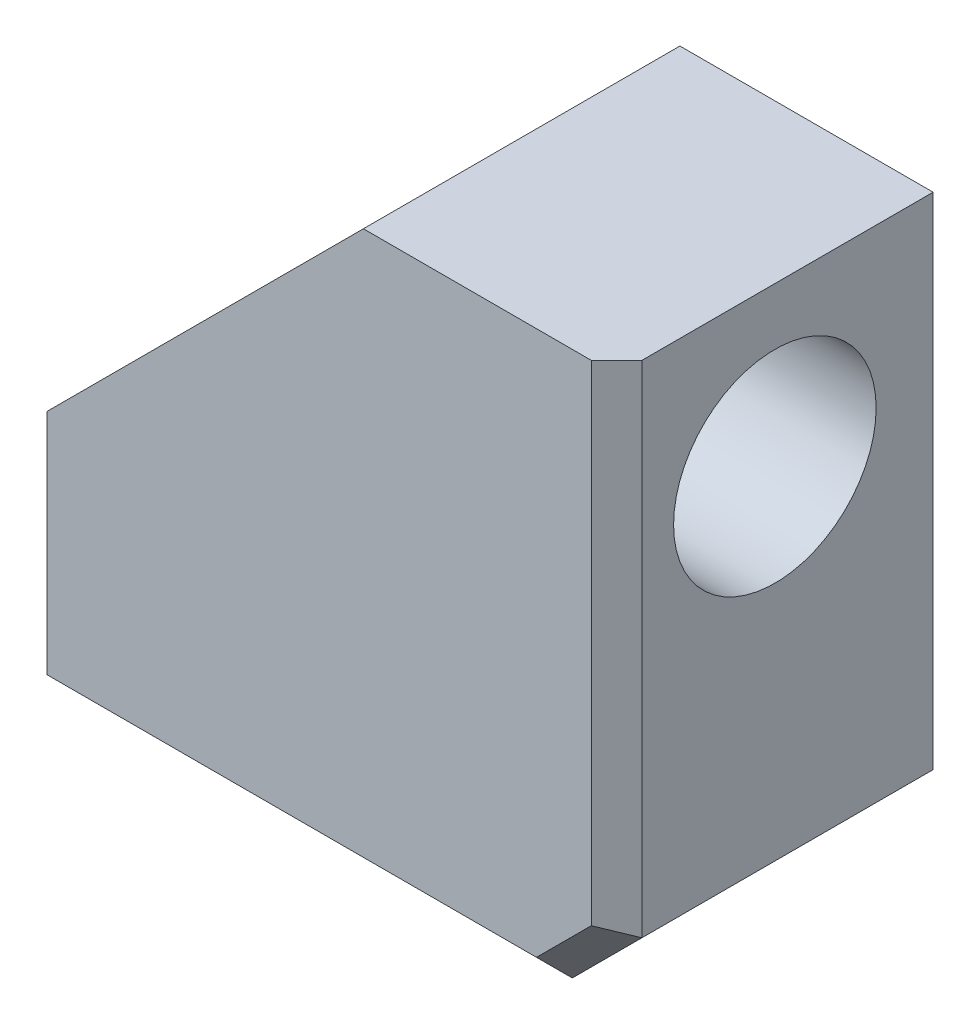
ISO-10303-21;
HEADER;
FILE_DESCRIPTION(('STEP AP214'),'2;1');
FILE_NAME('part.step','',(''),(''),'','','');
FILE_SCHEMA(('AUTOMOTIVE_DESIGN { 1 0 10303 214 1 1 1 1 }'));
ENDSEC;
DATA;
#1=APPLICATION_CONTEXT('core data for automotive mechanical design processes');
#2=APPLICATION_PROTOCOL_DEFINITION('international standard','automotive_design',2000,#1);
#3=PRODUCT_CONTEXT('',#1,'mechanical');
#4=PRODUCT('Part','Part','',(#3));
#5=PRODUCT_RELATED_PRODUCT_CATEGORY('part','',(#4));
#6=PRODUCT_DEFINITION_FORMATION('','',#4);
#7=PRODUCT_DEFINITION_CONTEXT('part definition',#1,'design');
#8=PRODUCT_DEFINITION('design','',#6,#7);
#9=PRODUCT_DEFINITION_SHAPE('','',#8);
#10=(LENGTH_UNIT() NAMED_UNIT(*) SI_UNIT(.MILLI.,.METRE.));
#11=(NAMED_UNIT(*) PLANE_ANGLE_UNIT() SI_UNIT($,.RADIAN.));
#12=(NAMED_UNIT(*) SI_UNIT($,.STERADIAN.) SOLID_ANGLE_UNIT());
#13=UNCERTAINTY_MEASURE_WITH_UNIT(LENGTH_MEASURE(1.E-05),#10,'distance_accuracy_value','');
#14=(GEOMETRIC_REPRESENTATION_CONTEXT(3) GLOBAL_UNCERTAINTY_ASSIGNED_CONTEXT((#13)) GLOBAL_UNIT_ASSIGNED_CONTEXT((#10,
#11,#12)) REPRESENTATION_CONTEXT('',''));
#15=CARTESIAN_POINT('',(0.,0.,0.));
#16=DIRECTION('',(0.,0.,1.));
#17=DIRECTION('',(1.,0.,0.));
#18=AXIS2_PLACEMENT_3D('',#15,#16,#17);
#19=CARTESIAN_POINT('',(-4.5,4.5,5.));
#20=DIRECTION('',(1.,0.,0.));
#21=DIRECTION('',(0.,0.,-1.));
#22=AXIS2_PLACEMENT_3D('',#19,#20,#21);
#23=PLANE('',#22);
#24=DIRECTION('',(0.,0.,-1.));
#25=VECTOR('',#24,1.);
#26=CARTESIAN_POINT('',(-4.5,-4.5,5.));
#27=LINE('',#26,#25);
#28=CARTESIAN_POINT('',(-4.5,-4.5,4.6));
#29=VERTEX_POINT('',#28);
#30=CARTESIAN_POINT('',(-4.5,-4.5,0.));
#31=VERTEX_POINT('',#30);
#32=EDGE_CURVE('E99',#29,#31,#27,.T.);
#33=ORIENTED_EDGE('',*,*,#32,.F.);
#34=DIRECTION('',(0.,0.707106781186546,0.707106781186549));
#35=VECTOR('',#34,1.);
#36=CARTESIAN_POINT('',(-4.5,-4.1,5.));
#37=LINE('',#36,#35);
#38=CARTESIAN_POINT('',(-4.5,-4.1,5.));
#39=VERTEX_POINT('',#38);
#40=EDGE_CURVE('E11',#29,#39,#37,.T.);
#41=ORIENTED_EDGE('',*,*,#40,.T.);
#42=DIRECTION('',(0.,-1.,0.));
#43=VECTOR('',#42,1.);
#44=CARTESIAN_POINT('',(-4.5,4.5,5.));
#45=LINE('',#44,#43);
#46=CARTESIAN_POINT('',(-4.5,-0.499999999999999,5.));
#47=VERTEX_POINT('',#46);
#48=EDGE_CURVE('E131',#47,#39,#45,.T.);
#49=ORIENTED_EDGE('',*,*,#48,.F.);
#50=DIRECTION('',(0.,0.,-1.));
#51=VECTOR('',#50,1.);
#52=CARTESIAN_POINT('',(-4.5,-0.5,5.));
#53=LINE('',#52,#51);
#54=CARTESIAN_POINT('',(-4.5,-0.499999999999999,0.));
#55=VERTEX_POINT('',#54);
#56=EDGE_CURVE('E114',#47,#55,#53,.T.);
#57=ORIENTED_EDGE('',*,*,#56,.T.);
#58=DIRECTION('',(0.,-1.,0.));
#59=VECTOR('',#58,1.);
#60=CARTESIAN_POINT('',(-4.5,4.5,0.));
#61=LINE('',#60,#59);
#62=EDGE_CURVE('E111',#55,#31,#61,.T.);
#63=ORIENTED_EDGE('',*,*,#62,.T.);
#64=EDGE_LOOP('',(#33,#41,#49,#57,#63));
#65=FACE_BOUND('',#64,.T.);
#66=ADVANCED_FACE('F34',(#65),#23,.F.);
#67=CARTESIAN_POINT('',(-4.5,-4.5,5.));
#68=DIRECTION('',(0.,1.,0.));
#69=DIRECTION('',(0.,0.,1.));
#70=AXIS2_PLACEMENT_3D('',#67,#68,#69);
#71=PLANE('',#70);
#72=CARTESIAN_POINT('',(-2.,-4.5,2.5));
#73=DIRECTION('',(0.,-1.,0.));
#74=DIRECTION('',(0.,0.,-1.));
#75=AXIS2_PLACEMENT_3D('',#72,#73,#74);
#76=CIRCLE('',#75,1.6);
#77=CARTESIAN_POINT('',(-2.,-4.5,0.9));
#78=VERTEX_POINT('',#77);
#79=EDGE_CURVE('E165',#78,#78,#76,.T.);
#80=ORIENTED_EDGE('',*,*,#79,.F.);
#81=EDGE_LOOP('',(#80));
#82=FACE_BOUND('',#81,.T.);
#83=DIRECTION('',(0.,0.,1.));
#84=VECTOR('',#83,1.);
#85=CARTESIAN_POINT('',(3.4,-4.5,5.));
#86=LINE('',#85,#84);
#87=CARTESIAN_POINT('',(3.4,-4.5,0.));
#88=VERTEX_POINT('',#87);
#89=CARTESIAN_POINT('',(3.4,-4.5,4.6));
#90=VERTEX_POINT('',#89);
#91=EDGE_CURVE('E136',#88,#90,#86,.T.);
#92=ORIENTED_EDGE('',*,*,#91,.T.);
#93=DIRECTION('',(-1.,0.,0.));
#94=VECTOR('',#93,1.);
#95=CARTESIAN_POINT('',(-4.5,-4.5,4.6));
#96=LINE('',#95,#94);
#97=EDGE_CURVE('E43',#90,#29,#96,.T.);
#98=ORIENTED_EDGE('',*,*,#97,.T.);
#99=ORIENTED_EDGE('',*,*,#32,.T.);
#100=DIRECTION('',(1.,0.,0.));
#101=VECTOR('',#100,1.);
#102=CARTESIAN_POINT('',(-4.5,-4.5,0.));
#103=LINE('',#102,#101);
#104=EDGE_CURVE('E103',#31,#88,#103,.T.);
#105=ORIENTED_EDGE('',*,*,#104,.T.);
#106=EDGE_LOOP('',(#92,#98,#99,#105));
#107=FACE_BOUND('',#106,.T.);
#108=ADVANCED_FACE('F101',(#82,#107),#71,.F.);
#109=CARTESIAN_POINT('',(4.5,4.5,5.));
#110=DIRECTION('',(-1.,0.,0.));
#111=DIRECTION('',(0.,0.,1.));
#112=AXIS2_PLACEMENT_3D('',#109,#110,#111);
#113=PLANE('',#112);
#114=CARTESIAN_POINT('',(4.5,2.,2.5));
#115=DIRECTION('',(1.,0.,0.));
#116=DIRECTION('',(0.,0.,-1.));
#117=AXIS2_PLACEMENT_3D('',#114,#115,#116);
#118=CIRCLE('',#117,1.6);
#119=CARTESIAN_POINT('',(4.5,2.,0.9));
#120=VERTEX_POINT('',#119);
#121=EDGE_CURVE('E175',#120,#120,#118,.T.);
#122=ORIENTED_EDGE('',*,*,#121,.F.);
#123=EDGE_LOOP('',(#122));
#124=FACE_BOUND('',#123,.T.);
#125=DIRECTION('',(0.,0.,-1.));
#126=VECTOR('',#125,1.);
#127=CARTESIAN_POINT('',(4.5,4.5,5.));
#128=LINE('',#127,#126);
#129=CARTESIAN_POINT('',(4.5,4.5,4.6));
#130=VERTEX_POINT('',#129);
#131=CARTESIAN_POINT('',(4.5,4.5,0.));
#132=VERTEX_POINT('',#131);
#133=EDGE_CURVE('E107',#130,#132,#128,.T.);
#134=ORIENTED_EDGE('',*,*,#133,.F.);
#135=DIRECTION('',(0.,-1.,0.));
#136=VECTOR('',#135,1.);
#137=CARTESIAN_POINT('',(4.5,-3.39999999999999,4.6));
#138=LINE('',#137,#136);
#139=CARTESIAN_POINT('',(4.5,-3.4,4.6));
#140=VERTEX_POINT('',#139);
#141=EDGE_CURVE('E155',#130,#140,#138,.T.);
#142=ORIENTED_EDGE('',*,*,#141,.T.);
#143=DIRECTION('',(0.,0.,-1.));
#144=VECTOR('',#143,1.);
#145=CARTESIAN_POINT('',(4.5,-3.4,5.));
#146=LINE('',#145,#144);
#147=CARTESIAN_POINT('',(4.5,-3.39999999999999,0.));
#148=VERTEX_POINT('',#147);
#149=EDGE_CURVE('E106',#140,#148,#146,.T.);
#150=ORIENTED_EDGE('',*,*,#149,.T.);
#151=DIRECTION('',(0.,1.,0.));
#152=VECTOR('',#151,1.);
#153=CARTESIAN_POINT('',(4.5,4.5,0.));
#154=LINE('',#153,#152);
#155=EDGE_CURVE('E122',#148,#132,#154,.T.);
#156=ORIENTED_EDGE('',*,*,#155,.T.);
#157=EDGE_LOOP('',(#134,#142,#150,#156));
#158=FACE_BOUND('',#157,.T.);
#159=ADVANCED_FACE('F201',(#124,#158),#113,.F.);
#160=CARTESIAN_POINT('',(-4.5,4.5,5.));
#161=DIRECTION('',(0.,-1.,0.));
#162=DIRECTION('',(0.,0.,-1.));
#163=AXIS2_PLACEMENT_3D('',#160,#161,#162);
#164=PLANE('',#163);
#165=DIRECTION('',(-1.,0.,0.));
#166=VECTOR('',#165,1.);
#167=CARTESIAN_POINT('',(-4.5,4.5,5.));
#168=LINE('',#167,#166);
#169=CARTESIAN_POINT('',(4.1,4.5,5.));
#170=VERTEX_POINT('',#169);
#171=CARTESIAN_POINT('',(0.50000000000002,4.5,5.));
#172=VERTEX_POINT('',#171);
#173=EDGE_CURVE('E132',#170,#172,#168,.T.);
#174=ORIENTED_EDGE('',*,*,#173,.F.);
#175=DIRECTION('',(0.707106781186546,0.,-0.707106781186549));
#176=VECTOR('',#175,1.);
#177=CARTESIAN_POINT('',(4.1,4.5,5.));
#178=LINE('',#177,#176);
#179=EDGE_CURVE('E153',#170,#130,#178,.T.);
#180=ORIENTED_EDGE('',*,*,#179,.T.);
#181=ORIENTED_EDGE('',*,*,#133,.T.);
#182=DIRECTION('',(-1.,0.,0.));
#183=VECTOR('',#182,1.);
#184=CARTESIAN_POINT('',(-4.5,4.5,0.));
#185=LINE('',#184,#183);
#186=CARTESIAN_POINT('',(0.50000000000002,4.5,0.));
#187=VERTEX_POINT('',#186);
#188=EDGE_CURVE('E125',#132,#187,#185,.T.);
#189=ORIENTED_EDGE('',*,*,#188,.T.);
#190=DIRECTION('',(0.,0.,1.));
#191=VECTOR('',#190,1.);
#192=CARTESIAN_POINT('',(0.50000000000002,4.5,5.));
#193=LINE('',#192,#191);
#194=EDGE_CURVE('E141',#187,#172,#193,.T.);
#195=ORIENTED_EDGE('',*,*,#194,.T.);
#196=EDGE_LOOP('',(#174,#180,#181,#189,#195));
#197=FACE_BOUND('',#196,.T.);
#198=ADVANCED_FACE('F195',(#197),#164,.F.);
#199=CARTESIAN_POINT('',(0.,0.,5.));
#200=DIRECTION('',(0.,0.,1.));
#201=DIRECTION('',(1.,0.,0.));
#202=AXIS2_PLACEMENT_3D('',#199,#200,#201);
#203=PLANE('',#202);
#204=DIRECTION('',(0.707106781186548,0.707106781186547,0.));
#205=VECTOR('',#204,1.);
#206=CARTESIAN_POINT('',(3.66715728752538,-3.66715728752538,5.));
#207=LINE('',#206,#205);
#208=CARTESIAN_POINT('',(3.23431457505076,-4.1,5.));
#209=VERTEX_POINT('',#208);
#210=CARTESIAN_POINT('',(4.1,-3.23431457505076,5.));
#211=VERTEX_POINT('',#210);
#212=EDGE_CURVE('E148',#209,#211,#207,.T.);
#213=ORIENTED_EDGE('',*,*,#212,.T.);
#214=DIRECTION('',(0.,1.,0.));
#215=VECTOR('',#214,1.);
#216=CARTESIAN_POINT('',(4.1,4.5,5.));
#217=LINE('',#216,#215);
#218=EDGE_CURVE('E150',#211,#170,#217,.T.);
#219=ORIENTED_EDGE('',*,*,#218,.T.);
#220=ORIENTED_EDGE('',*,*,#173,.T.);
#221=DIRECTION('',(0.707106781186549,0.707106781186546,0.));
#222=VECTOR('',#221,1.);
#223=CARTESIAN_POINT('',(-1.99999999999999,2.,5.));
#224=LINE('',#223,#222);
#225=EDGE_CURVE('E144',#172,#47,#224,.F.);
#226=ORIENTED_EDGE('',*,*,#225,.T.);
#227=ORIENTED_EDGE('',*,*,#48,.T.);
#228=DIRECTION('',(1.,0.,0.));
#229=VECTOR('',#228,1.);
#230=CARTESIAN_POINT('',(3.39999999999999,-4.1,5.));
#231=LINE('',#230,#229);
#232=EDGE_CURVE('E146',#39,#209,#231,.T.);
#233=ORIENTED_EDGE('',*,*,#232,.T.);
#234=EDGE_LOOP('',(#213,#219,#220,#226,#227,#233));
#235=FACE_BOUND('',#234,.T.);
#236=ADVANCED_FACE('F191',(#235),#203,.T.);
#237=CARTESIAN_POINT('',(0.,0.,0.));
#238=DIRECTION('',(0.,0.,1.));
#239=DIRECTION('',(1.,0.,0.));
#240=AXIS2_PLACEMENT_3D('',#237,#238,#239);
#241=PLANE('',#240);
#242=CARTESIAN_POINT('',(2.,-2.,0.));
#243=DIRECTION('',(0.,0.,-1.));
#244=DIRECTION('',(-1.,0.,0.));
#245=AXIS2_PLACEMENT_3D('',#242,#243,#244);
#246=CIRCLE('',#245,1.6);
#247=CARTESIAN_POINT('',(0.4,-2.,0.));
#248=VERTEX_POINT('',#247);
#249=EDGE_CURVE('E181',#248,#248,#246,.T.);
#250=ORIENTED_EDGE('',*,*,#249,.F.);
#251=EDGE_LOOP('',(#250));
#252=FACE_BOUND('',#251,.T.);
#253=ORIENTED_EDGE('',*,*,#62,.F.);
#254=DIRECTION('',(-0.707106781186549,-0.707106781186546,0.));
#255=VECTOR('',#254,1.);
#256=CARTESIAN_POINT('',(-4.5,-0.5,0.));
#257=LINE('',#256,#255);
#258=EDGE_CURVE('E139',#55,#187,#257,.F.);
#259=ORIENTED_EDGE('',*,*,#258,.T.);
#260=ORIENTED_EDGE('',*,*,#188,.F.);
#261=ORIENTED_EDGE('',*,*,#155,.F.);
#262=DIRECTION('',(0.707106781186548,0.707106781186547,0.));
#263=VECTOR('',#262,1.);
#264=CARTESIAN_POINT('',(4.5,-3.4,0.));
#265=LINE('',#264,#263);
#266=EDGE_CURVE('E121',#148,#88,#265,.F.);
#267=ORIENTED_EDGE('',*,*,#266,.T.);
#268=ORIENTED_EDGE('',*,*,#104,.F.);
#269=EDGE_LOOP('',(#253,#259,#260,#261,#267,#268));
#270=FACE_BOUND('',#269,.T.);
#271=ADVANCED_FACE('F118',(#252,#270),#241,.F.);
#272=CARTESIAN_POINT('',(2.,-2.,4.5));
#273=DIRECTION('',(0.,0.,-1.));
#274=DIRECTION('',(-1.,0.,0.));
#275=AXIS2_PLACEMENT_3D('',#272,#273,#274);
#276=CYLINDRICAL_SURFACE('',#275,1.6);
#277=CARTESIAN_POINT('',(2.,-2.,4.5));
#278=DIRECTION('',(0.,0.,-1.));
#279=DIRECTION('',(-1.,0.,0.));
#280=AXIS2_PLACEMENT_3D('',#277,#278,#279);
#281=CIRCLE('',#280,1.6);
#282=CARTESIAN_POINT('',(0.4,-2.,4.5));
#283=VERTEX_POINT('',#282);
#284=EDGE_CURVE('E116',#283,#283,#281,.T.);
#285=ORIENTED_EDGE('',*,*,#284,.F.);
#286=EDGE_LOOP('',(#285));
#287=FACE_BOUND('',#286,.T.);
#288=ORIENTED_EDGE('',*,*,#249,.T.);
#289=EDGE_LOOP('',(#288));
#290=FACE_BOUND('',#289,.T.);
#291=ADVANCED_FACE('F296',(#287,#290),#276,.F.);
#292=CARTESIAN_POINT('',(2.,-2.,4.5));
#293=DIRECTION('',(0.,0.,-1.));
#294=DIRECTION('',(-1.,0.,0.));
#295=AXIS2_PLACEMENT_3D('',#292,#293,#294);
#296=PLANE('',#295);
#297=ORIENTED_EDGE('',*,*,#284,.T.);
#298=EDGE_LOOP('',(#297));
#299=FACE_BOUND('',#298,.T.);
#300=ADVANCED_FACE('F287',(#299),#296,.T.);
#301=CARTESIAN_POINT('',(0.,2.,2.5));
#302=DIRECTION('',(1.,0.,0.));
#303=DIRECTION('',(0.,0.,-1.));
#304=AXIS2_PLACEMENT_3D('',#301,#302,#303);
#305=CYLINDRICAL_SURFACE('',#304,1.6);
#306=CARTESIAN_POINT('',(0.,2.,2.5));
#307=DIRECTION('',(1.,0.,0.));
#308=DIRECTION('',(0.,0.,-1.));
#309=AXIS2_PLACEMENT_3D('',#306,#307,#308);
#310=CIRCLE('',#309,1.6);
#311=CARTESIAN_POINT('',(0.,2.,0.9));
#312=VERTEX_POINT('',#311);
#313=EDGE_CURVE('E178',#312,#312,#310,.T.);
#314=ORIENTED_EDGE('',*,*,#313,.F.);
#315=EDGE_LOOP('',(#314));
#316=FACE_BOUND('',#315,.T.);
#317=ORIENTED_EDGE('',*,*,#121,.T.);
#318=EDGE_LOOP('',(#317));
#319=FACE_BOUND('',#318,.T.);
#320=ADVANCED_FACE('F278',(#316,#319),#305,.F.);
#321=CARTESIAN_POINT('',(0.,2.,2.5));
#322=DIRECTION('',(1.,0.,0.));
#323=DIRECTION('',(0.,0.,-1.));
#324=AXIS2_PLACEMENT_3D('',#321,#322,#323);
#325=PLANE('',#324);
#326=ORIENTED_EDGE('',*,*,#313,.T.);
#327=EDGE_LOOP('',(#326));
#328=FACE_BOUND('',#327,.T.);
#329=ADVANCED_FACE('F269',(#328),#325,.T.);
#330=CARTESIAN_POINT('',(-2.,0.,2.5));
#331=DIRECTION('',(0.,-1.,0.));
#332=DIRECTION('',(0.,0.,-1.));
#333=AXIS2_PLACEMENT_3D('',#330,#331,#332);
#334=CYLINDRICAL_SURFACE('',#333,1.6);
#335=CARTESIAN_POINT('',(-2.,0.,2.5));
#336=DIRECTION('',(0.,-1.,0.));
#337=DIRECTION('',(0.,0.,-1.));
#338=AXIS2_PLACEMENT_3D('',#335,#336,#337);
#339=CIRCLE('',#338,1.6);
#340=CARTESIAN_POINT('',(-2.,0.,0.9));
#341=VERTEX_POINT('',#340);
#342=EDGE_CURVE('E170',#341,#341,#339,.T.);
#343=ORIENTED_EDGE('',*,*,#342,.F.);
#344=EDGE_LOOP('',(#343));
#345=FACE_BOUND('',#344,.T.);
#346=ORIENTED_EDGE('',*,*,#79,.T.);
#347=EDGE_LOOP('',(#346));
#348=FACE_BOUND('',#347,.T.);
#349=ADVANCED_FACE('F260',(#345,#348),#334,.F.);
#350=CARTESIAN_POINT('',(-2.,0.,2.5));
#351=DIRECTION('',(0.,-1.,0.));
#352=DIRECTION('',(0.,0.,-1.));
#353=AXIS2_PLACEMENT_3D('',#350,#351,#352);
#354=PLANE('',#353);
#355=ORIENTED_EDGE('',*,*,#342,.T.);
#356=EDGE_LOOP('',(#355));
#357=FACE_BOUND('',#356,.T.);
#358=ADVANCED_FACE('F224',(#357),#354,.T.);
#359=CARTESIAN_POINT('',(4.5,-3.4,5.));
#360=DIRECTION('',(-0.707106781186547,0.707106781186548,0.));
#361=DIRECTION('',(0.,0.,-1.));
#362=AXIS2_PLACEMENT_3D('',#359,#360,#361);
#363=PLANE('',#362);
#364=ORIENTED_EDGE('',*,*,#149,.F.);
#365=DIRECTION('',(0.707106781186548,0.707106781186547,0.));
#366=VECTOR('',#365,1.);
#367=CARTESIAN_POINT('',(4.5,-3.4,4.6));
#368=LINE('',#367,#366);
#369=EDGE_CURVE('E58',#140,#90,#368,.F.);
#370=ORIENTED_EDGE('',*,*,#369,.T.);
#371=ORIENTED_EDGE('',*,*,#91,.F.);
#372=ORIENTED_EDGE('',*,*,#266,.F.);
#373=EDGE_LOOP('',(#364,#370,#371,#372));
#374=FACE_BOUND('',#373,.T.);
#375=ADVANCED_FACE('F202',(#374),#363,.F.);
#376=CARTESIAN_POINT('',(-4.5,-0.5,5.));
#377=DIRECTION('',(0.707106781186546,-0.707106781186549,0.));
#378=DIRECTION('',(0.,0.,-1.));
#379=AXIS2_PLACEMENT_3D('',#376,#377,#378);
#380=PLANE('',#379);
#381=ORIENTED_EDGE('',*,*,#225,.F.);
#382=ORIENTED_EDGE('',*,*,#194,.F.);
#383=ORIENTED_EDGE('',*,*,#258,.F.);
#384=ORIENTED_EDGE('',*,*,#56,.F.);
#385=EDGE_LOOP('',(#381,#382,#383,#384));
#386=FACE_BOUND('',#385,.T.);
#387=ADVANCED_FACE('F198',(#386),#380,.F.);
#388=CARTESIAN_POINT('',(0.,-4.1,5.));
#389=DIRECTION('',(0.,-0.707106781186549,0.707106781186546));
#390=DIRECTION('',(-1.,0.,0.));
#391=AXIS2_PLACEMENT_3D('',#388,#389,#390);
#392=PLANE('',#391);
#393=ORIENTED_EDGE('',*,*,#40,.F.);
#394=ORIENTED_EDGE('',*,*,#97,.F.);
#395=DIRECTION('',(-0.28108463771482,0.678598344545846,0.678598344545849));
#396=VECTOR('',#395,1.);
#397=CARTESIAN_POINT('',(2.97877599403403,-3.48307529199985,5.61692470800015));
#398=LINE('',#397,#396);
#399=EDGE_CURVE('E38',#209,#90,#398,.F.);
#400=ORIENTED_EDGE('',*,*,#399,.F.);
#401=ORIENTED_EDGE('',*,*,#232,.F.);
#402=EDGE_LOOP('',(#393,#394,#400,#401));
#403=FACE_BOUND('',#402,.T.);
#404=ADVANCED_FACE('F36',(#403),#392,.T.);
#405=CARTESIAN_POINT('',(3.66715728752538,-3.66715728752538,5.));
#406=DIRECTION('',(0.500000000000001,-0.500000000000001,0.707106781186546));
#407=DIRECTION('',(-0.707106781186548,-0.707106781186547,0.));
#408=AXIS2_PLACEMENT_3D('',#405,#406,#407);
#409=PLANE('',#408);
#410=ORIENTED_EDGE('',*,*,#399,.T.);
#411=ORIENTED_EDGE('',*,*,#369,.F.);
#412=DIRECTION('',(-0.678598344545845,0.281084637714821,0.678598344545848));
#413=VECTOR('',#412,1.);
#414=CARTESIAN_POINT('',(3.98323975055931,-3.18595089618636,5.11676024944069));
#415=LINE('',#414,#413);
#416=EDGE_CURVE('E158',#211,#140,#415,.F.);
#417=ORIENTED_EDGE('',*,*,#416,.F.);
#418=ORIENTED_EDGE('',*,*,#212,.F.);
#419=EDGE_LOOP('',(#410,#411,#417,#418));
#420=FACE_BOUND('',#419,.T.);
#421=ADVANCED_FACE('F205',(#420),#409,.T.);
#422=CARTESIAN_POINT('',(4.1,0.,5.));
#423=DIRECTION('',(0.707106781186549,0.,0.707106781186546));
#424=DIRECTION('',(0.,-1.,0.));
#425=AXIS2_PLACEMENT_3D('',#422,#423,#424);
#426=PLANE('',#425);
#427=ORIENTED_EDGE('',*,*,#416,.T.);
#428=ORIENTED_EDGE('',*,*,#141,.F.);
#429=ORIENTED_EDGE('',*,*,#179,.F.);
#430=ORIENTED_EDGE('',*,*,#218,.F.);
#431=EDGE_LOOP('',(#427,#428,#429,#430));
#432=FACE_BOUND('',#431,.T.);
#433=ADVANCED_FACE('F206',(#432),#426,.T.);
#434=CLOSED_SHELL('',(#66,#108,#159,#198,#236,#271,#291,#300,#320,#329,#349,#358,#375,#387,#404,
#421,#433));
#435=MANIFOLD_SOLID_BREP('B2',#434);
#436=ADVANCED_BREP_SHAPE_REPRESENTATION('',(#18,#435),#14);
#437=SHAPE_DEFINITION_REPRESENTATION(#9,#436);
ENDSEC;
END-ISO-10303-21;
